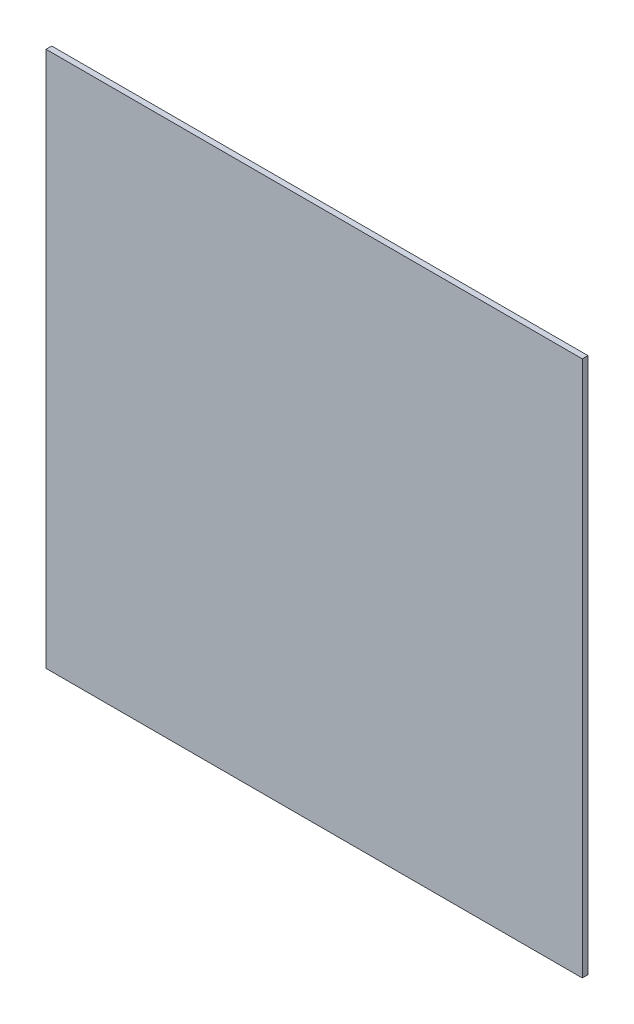
ISO-10303-21;
HEADER;
FILE_DESCRIPTION(('STEP AP214'),'2;1');
FILE_NAME('part.step','',(''),(''),'','','');
FILE_SCHEMA(('AUTOMOTIVE_DESIGN { 1 0 10303 214 1 1 1 1 }'));
ENDSEC;
DATA;
#1=APPLICATION_CONTEXT('core data for automotive mechanical design processes');
#2=APPLICATION_PROTOCOL_DEFINITION('international standard','automotive_design',2000,#1);
#3=PRODUCT_CONTEXT('',#1,'mechanical');
#4=PRODUCT('Part','Part','',(#3));
#5=PRODUCT_RELATED_PRODUCT_CATEGORY('part','',(#4));
#6=PRODUCT_DEFINITION_FORMATION('','',#4);
#7=PRODUCT_DEFINITION_CONTEXT('part definition',#1,'design');
#8=PRODUCT_DEFINITION('design','',#6,#7);
#9=PRODUCT_DEFINITION_SHAPE('','',#8);
#10=(LENGTH_UNIT() NAMED_UNIT(*) SI_UNIT(.MILLI.,.METRE.));
#11=(NAMED_UNIT(*) PLANE_ANGLE_UNIT() SI_UNIT($,.RADIAN.));
#12=(NAMED_UNIT(*) SI_UNIT($,.STERADIAN.) SOLID_ANGLE_UNIT());
#13=UNCERTAINTY_MEASURE_WITH_UNIT(LENGTH_MEASURE(1.E-05),#10,'distance_accuracy_value','');
#14=(GEOMETRIC_REPRESENTATION_CONTEXT(3) GLOBAL_UNCERTAINTY_ASSIGNED_CONTEXT((#13)) GLOBAL_UNIT_ASSIGNED_CONTEXT((#10,
#11,#12)) REPRESENTATION_CONTEXT('',''));
#15=CARTESIAN_POINT('',(0.,0.,0.));
#16=DIRECTION('',(0.,0.,1.));
#17=DIRECTION('',(1.,0.,0.));
#18=AXIS2_PLACEMENT_3D('',#15,#16,#17);
#19=CARTESIAN_POINT('',(-150.,150.,3.175));
#20=DIRECTION('',(1.,0.,0.));
#21=DIRECTION('',(0.,1.,0.));
#22=AXIS2_PLACEMENT_3D('',#19,#20,#21);
#23=PLANE('',#22);
#24=DIRECTION('',(0.,-1.,0.));
#25=VECTOR('',#24,1.);
#26=CARTESIAN_POINT('',(-150.,150.,0.));
#27=LINE('',#26,#25);
#28=CARTESIAN_POINT('',(-150.,150.,0.));
#29=VERTEX_POINT('',#28);
#30=CARTESIAN_POINT('',(-150.,-150.,0.));
#31=VERTEX_POINT('',#30);
#32=EDGE_CURVE('E96',#29,#31,#27,.T.);
#33=ORIENTED_EDGE('',*,*,#32,.T.);
#34=DIRECTION('',(0.,0.,-1.));
#35=VECTOR('',#34,1.);
#36=CARTESIAN_POINT('',(-150.,-150.,3.175));
#37=LINE('',#36,#35);
#38=CARTESIAN_POINT('',(-150.,-150.,3.175));
#39=VERTEX_POINT('',#38);
#40=EDGE_CURVE('E11',#39,#31,#37,.T.);
#41=ORIENTED_EDGE('',*,*,#40,.F.);
#42=DIRECTION('',(0.,-1.,0.));
#43=VECTOR('',#42,1.);
#44=CARTESIAN_POINT('',(-150.,150.,3.175));
#45=LINE('',#44,#43);
#46=CARTESIAN_POINT('',(-150.,150.,3.175));
#47=VERTEX_POINT('',#46);
#48=EDGE_CURVE('E84',#47,#39,#45,.T.);
#49=ORIENTED_EDGE('',*,*,#48,.F.);
#50=DIRECTION('',(0.,0.,-1.));
#51=VECTOR('',#50,1.);
#52=CARTESIAN_POINT('',(-150.,150.,3.175));
#53=LINE('',#52,#51);
#54=EDGE_CURVE('E92',#47,#29,#53,.T.);
#55=ORIENTED_EDGE('',*,*,#54,.T.);
#56=EDGE_LOOP('',(#33,#41,#49,#55));
#57=FACE_BOUND('',#56,.T.);
#58=ADVANCED_FACE('F33',(#57),#23,.F.);
#59=CARTESIAN_POINT('',(-150.,-150.,3.175));
#60=DIRECTION('',(0.,1.,0.));
#61=DIRECTION('',(0.,0.,1.));
#62=AXIS2_PLACEMENT_3D('',#59,#60,#61);
#63=PLANE('',#62);
#64=DIRECTION('',(1.,0.,0.));
#65=VECTOR('',#64,1.);
#66=CARTESIAN_POINT('',(-150.,-150.,0.));
#67=LINE('',#66,#65);
#68=CARTESIAN_POINT('',(150.,-150.,0.));
#69=VERTEX_POINT('',#68);
#70=EDGE_CURVE('E88',#31,#69,#67,.T.);
#71=ORIENTED_EDGE('',*,*,#70,.T.);
#72=DIRECTION('',(0.,0.,-1.));
#73=VECTOR('',#72,1.);
#74=CARTESIAN_POINT('',(150.,-150.,3.175));
#75=LINE('',#74,#73);
#76=CARTESIAN_POINT('',(150.,-150.,3.175));
#77=VERTEX_POINT('',#76);
#78=EDGE_CURVE('E41',#77,#69,#75,.T.);
#79=ORIENTED_EDGE('',*,*,#78,.F.);
#80=DIRECTION('',(1.,0.,0.));
#81=VECTOR('',#80,1.);
#82=CARTESIAN_POINT('',(-150.,-150.,3.175));
#83=LINE('',#82,#81);
#84=EDGE_CURVE('E79',#39,#77,#83,.T.);
#85=ORIENTED_EDGE('',*,*,#84,.F.);
#86=ORIENTED_EDGE('',*,*,#40,.T.);
#87=EDGE_LOOP('',(#71,#79,#85,#86));
#88=FACE_BOUND('',#87,.T.);
#89=ADVANCED_FACE('F87',(#88),#63,.F.);
#90=CARTESIAN_POINT('',(150.,150.,3.175));
#91=DIRECTION('',(-1.,0.,0.));
#92=DIRECTION('',(0.,-1.,0.));
#93=AXIS2_PLACEMENT_3D('',#90,#91,#92);
#94=PLANE('',#93);
#95=DIRECTION('',(0.,1.,0.));
#96=VECTOR('',#95,1.);
#97=CARTESIAN_POINT('',(150.,150.,0.));
#98=LINE('',#97,#96);
#99=CARTESIAN_POINT('',(150.,150.,0.));
#100=VERTEX_POINT('',#99);
#101=EDGE_CURVE('E66',#69,#100,#98,.T.);
#102=ORIENTED_EDGE('',*,*,#101,.T.);
#103=DIRECTION('',(0.,0.,-1.));
#104=VECTOR('',#103,1.);
#105=CARTESIAN_POINT('',(150.,150.,3.175));
#106=LINE('',#105,#104);
#107=CARTESIAN_POINT('',(150.,150.,3.175));
#108=VERTEX_POINT('',#107);
#109=EDGE_CURVE('E89',#108,#100,#106,.T.);
#110=ORIENTED_EDGE('',*,*,#109,.F.);
#111=DIRECTION('',(0.,1.,0.));
#112=VECTOR('',#111,1.);
#113=CARTESIAN_POINT('',(150.,150.,3.175));
#114=LINE('',#113,#112);
#115=EDGE_CURVE('E82',#77,#108,#114,.T.);
#116=ORIENTED_EDGE('',*,*,#115,.F.);
#117=ORIENTED_EDGE('',*,*,#78,.T.);
#118=EDGE_LOOP('',(#102,#110,#116,#117));
#119=FACE_BOUND('',#118,.T.);
#120=ADVANCED_FACE('F90',(#119),#94,.F.);
#121=CARTESIAN_POINT('',(-150.,150.,3.175));
#122=DIRECTION('',(0.,-1.,0.));
#123=DIRECTION('',(0.,0.,-1.));
#124=AXIS2_PLACEMENT_3D('',#121,#122,#123);
#125=PLANE('',#124);
#126=DIRECTION('',(-1.,0.,0.));
#127=VECTOR('',#126,1.);
#128=CARTESIAN_POINT('',(-150.,150.,0.));
#129=LINE('',#128,#127);
#130=EDGE_CURVE('E72',#100,#29,#129,.T.);
#131=ORIENTED_EDGE('',*,*,#130,.T.);
#132=ORIENTED_EDGE('',*,*,#54,.F.);
#133=DIRECTION('',(-1.,0.,0.));
#134=VECTOR('',#133,1.);
#135=CARTESIAN_POINT('',(-150.,150.,3.175));
#136=LINE('',#135,#134);
#137=EDGE_CURVE('E49',#108,#47,#136,.T.);
#138=ORIENTED_EDGE('',*,*,#137,.F.);
#139=ORIENTED_EDGE('',*,*,#109,.T.);
#140=EDGE_LOOP('',(#131,#132,#138,#139));
#141=FACE_BOUND('',#140,.T.);
#142=ADVANCED_FACE('F103',(#141),#125,.F.);
#143=CARTESIAN_POINT('',(-150.,-150.,3.175));
#144=DIRECTION('',(0.,0.,1.));
#145=DIRECTION('',(1.,0.,0.));
#146=AXIS2_PLACEMENT_3D('',#143,#144,#145);
#147=PLANE('',#146);
#148=ORIENTED_EDGE('',*,*,#48,.T.);
#149=ORIENTED_EDGE('',*,*,#84,.T.);
#150=ORIENTED_EDGE('',*,*,#115,.T.);
#151=ORIENTED_EDGE('',*,*,#137,.T.);
#152=EDGE_LOOP('',(#148,#149,#150,#151));
#153=FACE_BOUND('',#152,.T.);
#154=ADVANCED_FACE('F80',(#153),#147,.T.);
#155=CARTESIAN_POINT('',(-150.,-150.,0.));
#156=DIRECTION('',(0.,0.,1.));
#157=DIRECTION('',(1.,0.,0.));
#158=AXIS2_PLACEMENT_3D('',#155,#156,#157);
#159=PLANE('',#158);
#160=ORIENTED_EDGE('',*,*,#32,.F.);
#161=ORIENTED_EDGE('',*,*,#130,.F.);
#162=ORIENTED_EDGE('',*,*,#101,.F.);
#163=ORIENTED_EDGE('',*,*,#70,.F.);
#164=EDGE_LOOP('',(#160,#161,#162,#163));
#165=FACE_BOUND('',#164,.T.);
#166=ADVANCED_FACE('F106',(#165),#159,.F.);
#167=CLOSED_SHELL('',(#58,#89,#120,#142,#154,#166));
#168=MANIFOLD_SOLID_BREP('B2',#167);
#169=ADVANCED_BREP_SHAPE_REPRESENTATION('',(#18,#168),#14);
#170=SHAPE_DEFINITION_REPRESENTATION(#9,#169);
ENDSEC;
END-ISO-10303-21;
